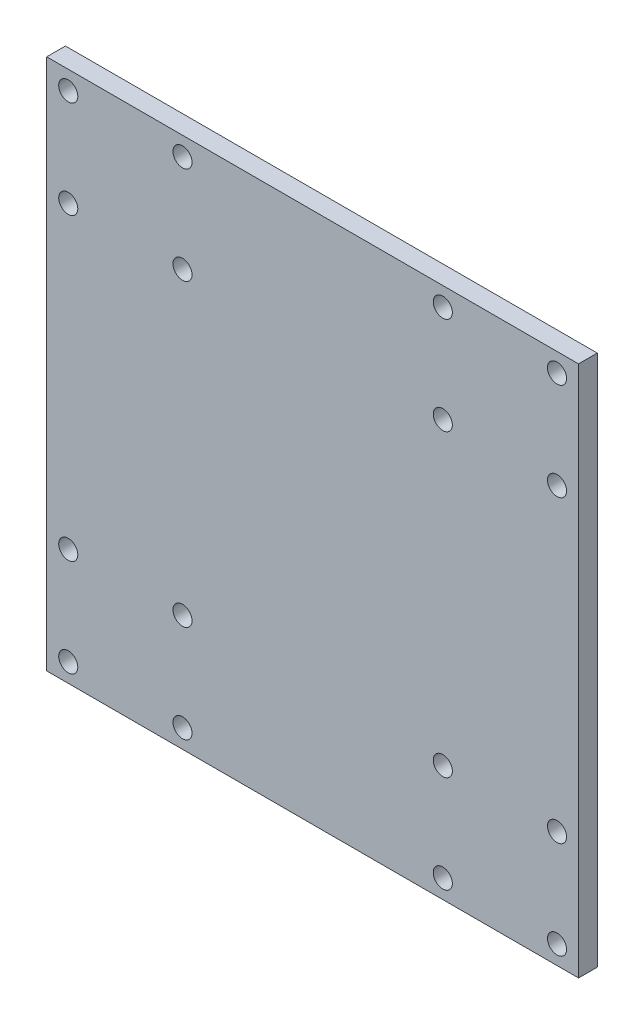
ISO-10303-21;
HEADER;
FILE_DESCRIPTION(('STEP AP214'),'2;1');
FILE_NAME('part.step','',(''),(''),'','','');
FILE_SCHEMA(('AUTOMOTIVE_DESIGN { 1 0 10303 214 1 1 1 1 }'));
ENDSEC;
DATA;
#1=APPLICATION_CONTEXT('core data for automotive mechanical design processes');
#2=APPLICATION_PROTOCOL_DEFINITION('international standard','automotive_design',2000,#1);
#3=PRODUCT_CONTEXT('',#1,'mechanical');
#4=PRODUCT('Part','Part','',(#3));
#5=PRODUCT_RELATED_PRODUCT_CATEGORY('part','',(#4));
#6=PRODUCT_DEFINITION_FORMATION('','',#4);
#7=PRODUCT_DEFINITION_CONTEXT('part definition',#1,'design');
#8=PRODUCT_DEFINITION('design','',#6,#7);
#9=PRODUCT_DEFINITION_SHAPE('','',#8);
#10=(LENGTH_UNIT() NAMED_UNIT(*) SI_UNIT(.MILLI.,.METRE.));
#11=(NAMED_UNIT(*) PLANE_ANGLE_UNIT() SI_UNIT($,.RADIAN.));
#12=(NAMED_UNIT(*) SI_UNIT($,.STERADIAN.) SOLID_ANGLE_UNIT());
#13=UNCERTAINTY_MEASURE_WITH_UNIT(LENGTH_MEASURE(1.E-05),#10,'distance_accuracy_value','');
#14=(GEOMETRIC_REPRESENTATION_CONTEXT(3) GLOBAL_UNCERTAINTY_ASSIGNED_CONTEXT((#13)) GLOBAL_UNIT_ASSIGNED_CONTEXT((#10,
#11,#12)) REPRESENTATION_CONTEXT('',''));
#15=CARTESIAN_POINT('',(0.,0.,0.));
#16=DIRECTION('',(0.,0.,1.));
#17=DIRECTION('',(1.,0.,0.));
#18=AXIS2_PLACEMENT_3D('',#15,#16,#17);
#19=CARTESIAN_POINT('',(71.,-71.,2.5));
#20=DIRECTION('',(-1.,0.,0.));
#21=DIRECTION('',(0.,0.,1.));
#22=AXIS2_PLACEMENT_3D('',#19,#20,#21);
#23=PLANE('',#22);
#24=DIRECTION('',(0.,1.,0.));
#25=VECTOR('',#24,1.);
#26=CARTESIAN_POINT('',(71.,-71.,-2.5));
#27=LINE('',#26,#25);
#28=CARTESIAN_POINT('',(71.,-71.,-2.5));
#29=VERTEX_POINT('',#28);
#30=CARTESIAN_POINT('',(71.,71.,-2.5));
#31=VERTEX_POINT('',#30);
#32=EDGE_CURVE('E95',#29,#31,#27,.T.);
#33=ORIENTED_EDGE('',*,*,#32,.T.);
#34=DIRECTION('',(0.,0.,-1.));
#35=VECTOR('',#34,1.);
#36=CARTESIAN_POINT('',(71.,71.,2.5));
#37=LINE('',#36,#35);
#38=CARTESIAN_POINT('',(71.,71.,2.5));
#39=VERTEX_POINT('',#38);
#40=EDGE_CURVE('E11',#39,#31,#37,.T.);
#41=ORIENTED_EDGE('',*,*,#40,.F.);
#42=DIRECTION('',(0.,1.,0.));
#43=VECTOR('',#42,1.);
#44=CARTESIAN_POINT('',(71.,-71.,2.5));
#45=LINE('',#44,#43);
#46=CARTESIAN_POINT('',(71.,-71.,2.5));
#47=VERTEX_POINT('',#46);
#48=EDGE_CURVE('E83',#47,#39,#45,.T.);
#49=ORIENTED_EDGE('',*,*,#48,.F.);
#50=DIRECTION('',(0.,0.,-1.));
#51=VECTOR('',#50,1.);
#52=CARTESIAN_POINT('',(71.,-71.,2.5));
#53=LINE('',#52,#51);
#54=EDGE_CURVE('E91',#47,#29,#53,.T.);
#55=ORIENTED_EDGE('',*,*,#54,.T.);
#56=EDGE_LOOP('',(#33,#41,#49,#55));
#57=FACE_BOUND('',#56,.T.);
#58=ADVANCED_FACE('F32',(#57),#23,.F.);
#59=CARTESIAN_POINT('',(-71.,71.,2.5));
#60=DIRECTION('',(0.,-1.,0.));
#61=DIRECTION('',(0.,0.,-1.));
#62=AXIS2_PLACEMENT_3D('',#59,#60,#61);
#63=PLANE('',#62);
#64=DIRECTION('',(-1.,0.,0.));
#65=VECTOR('',#64,1.);
#66=CARTESIAN_POINT('',(-71.,71.,-2.5));
#67=LINE('',#66,#65);
#68=CARTESIAN_POINT('',(-71.,71.,-2.5));
#69=VERTEX_POINT('',#68);
#70=EDGE_CURVE('E87',#31,#69,#67,.T.);
#71=ORIENTED_EDGE('',*,*,#70,.T.);
#72=DIRECTION('',(0.,0.,-1.));
#73=VECTOR('',#72,1.);
#74=CARTESIAN_POINT('',(-71.,71.,2.5));
#75=LINE('',#74,#73);
#76=CARTESIAN_POINT('',(-71.,71.,2.5));
#77=VERTEX_POINT('',#76);
#78=EDGE_CURVE('E40',#77,#69,#75,.T.);
#79=ORIENTED_EDGE('',*,*,#78,.F.);
#80=DIRECTION('',(-1.,0.,0.));
#81=VECTOR('',#80,1.);
#82=CARTESIAN_POINT('',(-71.,71.,2.5));
#83=LINE('',#82,#81);
#84=EDGE_CURVE('E78',#39,#77,#83,.T.);
#85=ORIENTED_EDGE('',*,*,#84,.F.);
#86=ORIENTED_EDGE('',*,*,#40,.T.);
#87=EDGE_LOOP('',(#71,#79,#85,#86));
#88=FACE_BOUND('',#87,.T.);
#89=ADVANCED_FACE('F86',(#88),#63,.F.);
#90=CARTESIAN_POINT('',(-71.,-71.,2.5));
#91=DIRECTION('',(1.,0.,0.));
#92=DIRECTION('',(0.,0.,-1.));
#93=AXIS2_PLACEMENT_3D('',#90,#91,#92);
#94=PLANE('',#93);
#95=DIRECTION('',(0.,-1.,0.));
#96=VECTOR('',#95,1.);
#97=CARTESIAN_POINT('',(-71.,-71.,-2.5));
#98=LINE('',#97,#96);
#99=CARTESIAN_POINT('',(-71.,-71.,-2.5));
#100=VERTEX_POINT('',#99);
#101=EDGE_CURVE('E65',#69,#100,#98,.T.);
#102=ORIENTED_EDGE('',*,*,#101,.T.);
#103=DIRECTION('',(0.,0.,-1.));
#104=VECTOR('',#103,1.);
#105=CARTESIAN_POINT('',(-71.,-71.,2.5));
#106=LINE('',#105,#104);
#107=CARTESIAN_POINT('',(-71.,-71.,2.5));
#108=VERTEX_POINT('',#107);
#109=EDGE_CURVE('E88',#108,#100,#106,.T.);
#110=ORIENTED_EDGE('',*,*,#109,.F.);
#111=DIRECTION('',(0.,-1.,0.));
#112=VECTOR('',#111,1.);
#113=CARTESIAN_POINT('',(-71.,-71.,2.5));
#114=LINE('',#113,#112);
#115=EDGE_CURVE('E81',#77,#108,#114,.T.);
#116=ORIENTED_EDGE('',*,*,#115,.F.);
#117=ORIENTED_EDGE('',*,*,#78,.T.);
#118=EDGE_LOOP('',(#102,#110,#116,#117));
#119=FACE_BOUND('',#118,.T.);
#120=ADVANCED_FACE('F89',(#119),#94,.F.);
#121=CARTESIAN_POINT('',(-71.,-71.,2.5));
#122=DIRECTION('',(0.,1.,0.));
#123=DIRECTION('',(0.,0.,1.));
#124=AXIS2_PLACEMENT_3D('',#121,#122,#123);
#125=PLANE('',#124);
#126=DIRECTION('',(1.,0.,0.));
#127=VECTOR('',#126,1.);
#128=CARTESIAN_POINT('',(-71.,-71.,-2.5));
#129=LINE('',#128,#127);
#130=EDGE_CURVE('E71',#100,#29,#129,.T.);
#131=ORIENTED_EDGE('',*,*,#130,.T.);
#132=ORIENTED_EDGE('',*,*,#54,.F.);
#133=DIRECTION('',(1.,0.,0.));
#134=VECTOR('',#133,1.);
#135=CARTESIAN_POINT('',(-71.,-71.,2.5));
#136=LINE('',#135,#134);
#137=EDGE_CURVE('E48',#108,#47,#136,.T.);
#138=ORIENTED_EDGE('',*,*,#137,.F.);
#139=ORIENTED_EDGE('',*,*,#109,.T.);
#140=EDGE_LOOP('',(#131,#132,#138,#139));
#141=FACE_BOUND('',#140,.T.);
#142=ADVANCED_FACE('F103',(#141),#125,.F.);
#143=CARTESIAN_POINT('',(0.,0.,2.5));
#144=DIRECTION('',(0.,0.,-1.));
#145=DIRECTION('',(-1.,0.,0.));
#146=AXIS2_PLACEMENT_3D('',#143,#144,#145);
#147=PLANE('',#146);
#148=CARTESIAN_POINT('',(34.75,-66.,2.5));
#149=DIRECTION('',(0.,0.,1.));
#150=DIRECTION('',(1.,0.,0.));
#151=AXIS2_PLACEMENT_3D('',#148,#149,#150);
#152=CIRCLE('',#151,2.55);
#153=CARTESIAN_POINT('',(37.3,-66.,2.5));
#154=VERTEX_POINT('',#153);
#155=EDGE_CURVE('E199',#154,#154,#152,.T.);
#156=ORIENTED_EDGE('',*,*,#155,.F.);
#157=EDGE_LOOP('',(#156));
#158=FACE_BOUND('',#157,.T.);
#159=CARTESIAN_POINT('',(65.25,-66.,2.5));
#160=DIRECTION('',(0.,0.,1.));
#161=DIRECTION('',(1.,0.,0.));
#162=AXIS2_PLACEMENT_3D('',#159,#160,#161);
#163=CIRCLE('',#162,2.54999999999999);
#164=CARTESIAN_POINT('',(67.8,-66.,2.5));
#165=VERTEX_POINT('',#164);
#166=EDGE_CURVE('E193',#165,#165,#163,.T.);
#167=ORIENTED_EDGE('',*,*,#166,.F.);
#168=EDGE_LOOP('',(#167));
#169=FACE_BOUND('',#168,.T.);
#170=CARTESIAN_POINT('',(65.25,-40.,2.5));
#171=DIRECTION('',(0.,0.,1.));
#172=DIRECTION('',(1.,0.,0.));
#173=AXIS2_PLACEMENT_3D('',#170,#171,#172);
#174=CIRCLE('',#173,2.54999999999999);
#175=CARTESIAN_POINT('',(67.8,-40.,2.5));
#176=VERTEX_POINT('',#175);
#177=EDGE_CURVE('E187',#176,#176,#174,.T.);
#178=ORIENTED_EDGE('',*,*,#177,.F.);
#179=EDGE_LOOP('',(#178));
#180=FACE_BOUND('',#179,.T.);
#181=CARTESIAN_POINT('',(34.75,-40.,2.5));
#182=DIRECTION('',(0.,0.,1.));
#183=DIRECTION('',(1.,0.,0.));
#184=AXIS2_PLACEMENT_3D('',#181,#182,#183);
#185=CIRCLE('',#184,2.55000000000001);
#186=CARTESIAN_POINT('',(37.3,-40.,2.5));
#187=VERTEX_POINT('',#186);
#188=EDGE_CURVE('E181',#187,#187,#185,.T.);
#189=ORIENTED_EDGE('',*,*,#188,.F.);
#190=EDGE_LOOP('',(#189));
#191=FACE_BOUND('',#190,.T.);
#192=CARTESIAN_POINT('',(-65.25,-66.,2.5));
#193=DIRECTION('',(0.,0.,1.));
#194=DIRECTION('',(1.,0.,0.));
#195=AXIS2_PLACEMENT_3D('',#192,#193,#194);
#196=CIRCLE('',#195,2.54999999999999);
#197=CARTESIAN_POINT('',(-62.7,-66.,2.5));
#198=VERTEX_POINT('',#197);
#199=EDGE_CURVE('E175',#198,#198,#196,.T.);
#200=ORIENTED_EDGE('',*,*,#199,.F.);
#201=EDGE_LOOP('',(#200));
#202=FACE_BOUND('',#201,.T.);
#203=CARTESIAN_POINT('',(-34.75,-66.,2.5));
#204=DIRECTION('',(0.,0.,1.));
#205=DIRECTION('',(1.,0.,0.));
#206=AXIS2_PLACEMENT_3D('',#203,#204,#205);
#207=CIRCLE('',#206,2.55);
#208=CARTESIAN_POINT('',(-32.2,-66.,2.5));
#209=VERTEX_POINT('',#208);
#210=EDGE_CURVE('E169',#209,#209,#207,.T.);
#211=ORIENTED_EDGE('',*,*,#210,.F.);
#212=EDGE_LOOP('',(#211));
#213=FACE_BOUND('',#212,.T.);
#214=CARTESIAN_POINT('',(-34.75,-40.,2.5));
#215=DIRECTION('',(0.,0.,1.));
#216=DIRECTION('',(1.,0.,0.));
#217=AXIS2_PLACEMENT_3D('',#214,#215,#216);
#218=CIRCLE('',#217,2.55000000000001);
#219=CARTESIAN_POINT('',(-32.2,-40.,2.5));
#220=VERTEX_POINT('',#219);
#221=EDGE_CURVE('E163',#220,#220,#218,.T.);
#222=ORIENTED_EDGE('',*,*,#221,.F.);
#223=EDGE_LOOP('',(#222));
#224=FACE_BOUND('',#223,.T.);
#225=CARTESIAN_POINT('',(-65.25,-40.,2.5));
#226=DIRECTION('',(0.,0.,1.));
#227=DIRECTION('',(1.,0.,0.));
#228=AXIS2_PLACEMENT_3D('',#225,#226,#227);
#229=CIRCLE('',#228,2.54999999999999);
#230=CARTESIAN_POINT('',(-62.7,-40.,2.5));
#231=VERTEX_POINT('',#230);
#232=EDGE_CURVE('E157',#231,#231,#229,.T.);
#233=ORIENTED_EDGE('',*,*,#232,.F.);
#234=EDGE_LOOP('',(#233));
#235=FACE_BOUND('',#234,.T.);
#236=CARTESIAN_POINT('',(34.75,66.,2.5));
#237=DIRECTION('',(0.,0.,1.));
#238=DIRECTION('',(1.,0.,0.));
#239=AXIS2_PLACEMENT_3D('',#236,#237,#238);
#240=CIRCLE('',#239,2.55);
#241=CARTESIAN_POINT('',(37.3,66.,2.5));
#242=VERTEX_POINT('',#241);
#243=EDGE_CURVE('E151',#242,#242,#240,.T.);
#244=ORIENTED_EDGE('',*,*,#243,.F.);
#245=EDGE_LOOP('',(#244));
#246=FACE_BOUND('',#245,.T.);
#247=CARTESIAN_POINT('',(34.75,40.,2.5));
#248=DIRECTION('',(0.,0.,1.));
#249=DIRECTION('',(1.,0.,0.));
#250=AXIS2_PLACEMENT_3D('',#247,#248,#249);
#251=CIRCLE('',#250,2.55000000000001);
#252=CARTESIAN_POINT('',(37.3,40.,2.5));
#253=VERTEX_POINT('',#252);
#254=EDGE_CURVE('E145',#253,#253,#251,.T.);
#255=ORIENTED_EDGE('',*,*,#254,.F.);
#256=EDGE_LOOP('',(#255));
#257=FACE_BOUND('',#256,.T.);
#258=CARTESIAN_POINT('',(65.25,40.,2.5));
#259=DIRECTION('',(0.,0.,1.));
#260=DIRECTION('',(1.,0.,0.));
#261=AXIS2_PLACEMENT_3D('',#258,#259,#260);
#262=CIRCLE('',#261,2.54999999999999);
#263=CARTESIAN_POINT('',(67.8,40.,2.5));
#264=VERTEX_POINT('',#263);
#265=EDGE_CURVE('E139',#264,#264,#262,.T.);
#266=ORIENTED_EDGE('',*,*,#265,.F.);
#267=EDGE_LOOP('',(#266));
#268=FACE_BOUND('',#267,.T.);
#269=CARTESIAN_POINT('',(65.25,66.,2.5));
#270=DIRECTION('',(0.,0.,1.));
#271=DIRECTION('',(1.,0.,0.));
#272=AXIS2_PLACEMENT_3D('',#269,#270,#271);
#273=CIRCLE('',#272,2.54999999999999);
#274=CARTESIAN_POINT('',(67.8,66.,2.5));
#275=VERTEX_POINT('',#274);
#276=EDGE_CURVE('E133',#275,#275,#273,.T.);
#277=ORIENTED_EDGE('',*,*,#276,.F.);
#278=EDGE_LOOP('',(#277));
#279=FACE_BOUND('',#278,.T.);
#280=CARTESIAN_POINT('',(-65.25,40.,2.5));
#281=DIRECTION('',(0.,0.,1.));
#282=DIRECTION('',(1.,0.,0.));
#283=AXIS2_PLACEMENT_3D('',#280,#281,#282);
#284=CIRCLE('',#283,2.54999999999999);
#285=CARTESIAN_POINT('',(-62.7,40.,2.5));
#286=VERTEX_POINT('',#285);
#287=EDGE_CURVE('E127',#286,#286,#284,.T.);
#288=ORIENTED_EDGE('',*,*,#287,.F.);
#289=EDGE_LOOP('',(#288));
#290=FACE_BOUND('',#289,.T.);
#291=CARTESIAN_POINT('',(-34.75,40.,2.5));
#292=DIRECTION('',(0.,0.,1.));
#293=DIRECTION('',(1.,0.,0.));
#294=AXIS2_PLACEMENT_3D('',#291,#292,#293);
#295=CIRCLE('',#294,2.55);
#296=CARTESIAN_POINT('',(-32.2,40.,2.5));
#297=VERTEX_POINT('',#296);
#298=EDGE_CURVE('E121',#297,#297,#295,.T.);
#299=ORIENTED_EDGE('',*,*,#298,.F.);
#300=EDGE_LOOP('',(#299));
#301=FACE_BOUND('',#300,.T.);
#302=CARTESIAN_POINT('',(-34.75,66.,2.5));
#303=DIRECTION('',(0.,0.,1.));
#304=DIRECTION('',(1.,0.,0.));
#305=AXIS2_PLACEMENT_3D('',#302,#303,#304);
#306=CIRCLE('',#305,2.55);
#307=CARTESIAN_POINT('',(-32.2,66.,2.5));
#308=VERTEX_POINT('',#307);
#309=EDGE_CURVE('E115',#308,#308,#306,.T.);
#310=ORIENTED_EDGE('',*,*,#309,.F.);
#311=EDGE_LOOP('',(#310));
#312=FACE_BOUND('',#311,.T.);
#313=CARTESIAN_POINT('',(-65.25,66.,2.5));
#314=DIRECTION('',(0.,0.,1.));
#315=DIRECTION('',(1.,0.,0.));
#316=AXIS2_PLACEMENT_3D('',#313,#314,#315);
#317=CIRCLE('',#316,2.54999999999999);
#318=CARTESIAN_POINT('',(-62.7,66.,2.5));
#319=VERTEX_POINT('',#318);
#320=EDGE_CURVE('E109',#319,#319,#317,.T.);
#321=ORIENTED_EDGE('',*,*,#320,.F.);
#322=EDGE_LOOP('',(#321));
#323=FACE_BOUND('',#322,.T.);
#324=ORIENTED_EDGE('',*,*,#48,.T.);
#325=ORIENTED_EDGE('',*,*,#84,.T.);
#326=ORIENTED_EDGE('',*,*,#115,.T.);
#327=ORIENTED_EDGE('',*,*,#137,.T.);
#328=EDGE_LOOP('',(#324,#325,#326,#327));
#329=FACE_BOUND('',#328,.T.);
#330=ADVANCED_FACE('F79',(#158,#169,#180,#191,#202,#213,#224,#235,#246,#257,#268,#279,#290,#301,
#312,#323,#329),#147,.F.);
#331=CARTESIAN_POINT('',(0.,0.,-2.5));
#332=DIRECTION('',(0.,0.,-1.));
#333=DIRECTION('',(-1.,0.,0.));
#334=AXIS2_PLACEMENT_3D('',#331,#332,#333);
#335=PLANE('',#334);
#336=CARTESIAN_POINT('',(34.75,-66.,-2.5));
#337=DIRECTION('',(0.,0.,1.));
#338=DIRECTION('',(1.,0.,0.));
#339=AXIS2_PLACEMENT_3D('',#336,#337,#338);
#340=CIRCLE('',#339,2.55);
#341=CARTESIAN_POINT('',(37.3,-66.,-2.5));
#342=VERTEX_POINT('',#341);
#343=EDGE_CURVE('E196',#342,#342,#340,.T.);
#344=ORIENTED_EDGE('',*,*,#343,.T.);
#345=EDGE_LOOP('',(#344));
#346=FACE_BOUND('',#345,.T.);
#347=CARTESIAN_POINT('',(65.25,-66.,-2.5));
#348=DIRECTION('',(0.,0.,1.));
#349=DIRECTION('',(1.,0.,0.));
#350=AXIS2_PLACEMENT_3D('',#347,#348,#349);
#351=CIRCLE('',#350,2.54999999999999);
#352=CARTESIAN_POINT('',(67.8,-66.,-2.5));
#353=VERTEX_POINT('',#352);
#354=EDGE_CURVE('E190',#353,#353,#351,.T.);
#355=ORIENTED_EDGE('',*,*,#354,.T.);
#356=EDGE_LOOP('',(#355));
#357=FACE_BOUND('',#356,.T.);
#358=CARTESIAN_POINT('',(65.25,-40.,-2.5));
#359=DIRECTION('',(0.,0.,1.));
#360=DIRECTION('',(1.,0.,0.));
#361=AXIS2_PLACEMENT_3D('',#358,#359,#360);
#362=CIRCLE('',#361,2.54999999999999);
#363=CARTESIAN_POINT('',(67.8,-40.,-2.5));
#364=VERTEX_POINT('',#363);
#365=EDGE_CURVE('E184',#364,#364,#362,.T.);
#366=ORIENTED_EDGE('',*,*,#365,.T.);
#367=EDGE_LOOP('',(#366));
#368=FACE_BOUND('',#367,.T.);
#369=CARTESIAN_POINT('',(34.75,-40.,-2.5));
#370=DIRECTION('',(0.,0.,1.));
#371=DIRECTION('',(1.,0.,0.));
#372=AXIS2_PLACEMENT_3D('',#369,#370,#371);
#373=CIRCLE('',#372,2.55000000000001);
#374=CARTESIAN_POINT('',(37.3,-40.,-2.5));
#375=VERTEX_POINT('',#374);
#376=EDGE_CURVE('E178',#375,#375,#373,.T.);
#377=ORIENTED_EDGE('',*,*,#376,.T.);
#378=EDGE_LOOP('',(#377));
#379=FACE_BOUND('',#378,.T.);
#380=CARTESIAN_POINT('',(-65.25,-66.,-2.5));
#381=DIRECTION('',(0.,0.,1.));
#382=DIRECTION('',(1.,0.,0.));
#383=AXIS2_PLACEMENT_3D('',#380,#381,#382);
#384=CIRCLE('',#383,2.54999999999999);
#385=CARTESIAN_POINT('',(-62.7,-66.,-2.5));
#386=VERTEX_POINT('',#385);
#387=EDGE_CURVE('E172',#386,#386,#384,.T.);
#388=ORIENTED_EDGE('',*,*,#387,.T.);
#389=EDGE_LOOP('',(#388));
#390=FACE_BOUND('',#389,.T.);
#391=CARTESIAN_POINT('',(-34.75,-66.,-2.5));
#392=DIRECTION('',(0.,0.,1.));
#393=DIRECTION('',(1.,0.,0.));
#394=AXIS2_PLACEMENT_3D('',#391,#392,#393);
#395=CIRCLE('',#394,2.55);
#396=CARTESIAN_POINT('',(-32.2,-66.,-2.5));
#397=VERTEX_POINT('',#396);
#398=EDGE_CURVE('E166',#397,#397,#395,.T.);
#399=ORIENTED_EDGE('',*,*,#398,.T.);
#400=EDGE_LOOP('',(#399));
#401=FACE_BOUND('',#400,.T.);
#402=CARTESIAN_POINT('',(-34.75,-40.,-2.5));
#403=DIRECTION('',(0.,0.,1.));
#404=DIRECTION('',(1.,0.,0.));
#405=AXIS2_PLACEMENT_3D('',#402,#403,#404);
#406=CIRCLE('',#405,2.55000000000001);
#407=CARTESIAN_POINT('',(-32.2,-40.,-2.5));
#408=VERTEX_POINT('',#407);
#409=EDGE_CURVE('E160',#408,#408,#406,.T.);
#410=ORIENTED_EDGE('',*,*,#409,.T.);
#411=EDGE_LOOP('',(#410));
#412=FACE_BOUND('',#411,.T.);
#413=CARTESIAN_POINT('',(-65.25,-40.,-2.5));
#414=DIRECTION('',(0.,0.,1.));
#415=DIRECTION('',(1.,0.,0.));
#416=AXIS2_PLACEMENT_3D('',#413,#414,#415);
#417=CIRCLE('',#416,2.54999999999999);
#418=CARTESIAN_POINT('',(-62.7,-40.,-2.5));
#419=VERTEX_POINT('',#418);
#420=EDGE_CURVE('E154',#419,#419,#417,.T.);
#421=ORIENTED_EDGE('',*,*,#420,.T.);
#422=EDGE_LOOP('',(#421));
#423=FACE_BOUND('',#422,.T.);
#424=CARTESIAN_POINT('',(34.75,66.,-2.5));
#425=DIRECTION('',(0.,0.,1.));
#426=DIRECTION('',(1.,0.,0.));
#427=AXIS2_PLACEMENT_3D('',#424,#425,#426);
#428=CIRCLE('',#427,2.55);
#429=CARTESIAN_POINT('',(37.3,66.,-2.5));
#430=VERTEX_POINT('',#429);
#431=EDGE_CURVE('E148',#430,#430,#428,.T.);
#432=ORIENTED_EDGE('',*,*,#431,.T.);
#433=EDGE_LOOP('',(#432));
#434=FACE_BOUND('',#433,.T.);
#435=CARTESIAN_POINT('',(34.75,40.,-2.5));
#436=DIRECTION('',(0.,0.,1.));
#437=DIRECTION('',(1.,0.,0.));
#438=AXIS2_PLACEMENT_3D('',#435,#436,#437);
#439=CIRCLE('',#438,2.55000000000001);
#440=CARTESIAN_POINT('',(37.3,40.,-2.5));
#441=VERTEX_POINT('',#440);
#442=EDGE_CURVE('E142',#441,#441,#439,.T.);
#443=ORIENTED_EDGE('',*,*,#442,.T.);
#444=EDGE_LOOP('',(#443));
#445=FACE_BOUND('',#444,.T.);
#446=CARTESIAN_POINT('',(65.25,40.,-2.5));
#447=DIRECTION('',(0.,0.,1.));
#448=DIRECTION('',(1.,0.,0.));
#449=AXIS2_PLACEMENT_3D('',#446,#447,#448);
#450=CIRCLE('',#449,2.54999999999999);
#451=CARTESIAN_POINT('',(67.8,40.,-2.5));
#452=VERTEX_POINT('',#451);
#453=EDGE_CURVE('E136',#452,#452,#450,.T.);
#454=ORIENTED_EDGE('',*,*,#453,.T.);
#455=EDGE_LOOP('',(#454));
#456=FACE_BOUND('',#455,.T.);
#457=CARTESIAN_POINT('',(65.25,66.,-2.5));
#458=DIRECTION('',(0.,0.,1.));
#459=DIRECTION('',(1.,0.,0.));
#460=AXIS2_PLACEMENT_3D('',#457,#458,#459);
#461=CIRCLE('',#460,2.54999999999999);
#462=CARTESIAN_POINT('',(67.8,66.,-2.5));
#463=VERTEX_POINT('',#462);
#464=EDGE_CURVE('E130',#463,#463,#461,.T.);
#465=ORIENTED_EDGE('',*,*,#464,.T.);
#466=EDGE_LOOP('',(#465));
#467=FACE_BOUND('',#466,.T.);
#468=CARTESIAN_POINT('',(-65.25,40.,-2.5));
#469=DIRECTION('',(0.,0.,1.));
#470=DIRECTION('',(1.,0.,0.));
#471=AXIS2_PLACEMENT_3D('',#468,#469,#470);
#472=CIRCLE('',#471,2.54999999999999);
#473=CARTESIAN_POINT('',(-62.7,40.,-2.5));
#474=VERTEX_POINT('',#473);
#475=EDGE_CURVE('E124',#474,#474,#472,.T.);
#476=ORIENTED_EDGE('',*,*,#475,.T.);
#477=EDGE_LOOP('',(#476));
#478=FACE_BOUND('',#477,.T.);
#479=CARTESIAN_POINT('',(-34.75,40.,-2.5));
#480=DIRECTION('',(0.,0.,1.));
#481=DIRECTION('',(1.,0.,0.));
#482=AXIS2_PLACEMENT_3D('',#479,#480,#481);
#483=CIRCLE('',#482,2.55);
#484=CARTESIAN_POINT('',(-32.2,40.,-2.5));
#485=VERTEX_POINT('',#484);
#486=EDGE_CURVE('E118',#485,#485,#483,.T.);
#487=ORIENTED_EDGE('',*,*,#486,.T.);
#488=EDGE_LOOP('',(#487));
#489=FACE_BOUND('',#488,.T.);
#490=CARTESIAN_POINT('',(-34.75,66.,-2.5));
#491=DIRECTION('',(0.,0.,1.));
#492=DIRECTION('',(1.,0.,0.));
#493=AXIS2_PLACEMENT_3D('',#490,#491,#492);
#494=CIRCLE('',#493,2.55);
#495=CARTESIAN_POINT('',(-32.2,66.,-2.5));
#496=VERTEX_POINT('',#495);
#497=EDGE_CURVE('E112',#496,#496,#494,.T.);
#498=ORIENTED_EDGE('',*,*,#497,.T.);
#499=EDGE_LOOP('',(#498));
#500=FACE_BOUND('',#499,.T.);
#501=CARTESIAN_POINT('',(-65.25,66.,-2.5));
#502=DIRECTION('',(0.,0.,1.));
#503=DIRECTION('',(1.,0.,0.));
#504=AXIS2_PLACEMENT_3D('',#501,#502,#503);
#505=CIRCLE('',#504,2.54999999999999);
#506=CARTESIAN_POINT('',(-62.7,66.,-2.5));
#507=VERTEX_POINT('',#506);
#508=EDGE_CURVE('E98',#507,#507,#505,.T.);
#509=ORIENTED_EDGE('',*,*,#508,.T.);
#510=EDGE_LOOP('',(#509));
#511=FACE_BOUND('',#510,.T.);
#512=ORIENTED_EDGE('',*,*,#32,.F.);
#513=ORIENTED_EDGE('',*,*,#130,.F.);
#514=ORIENTED_EDGE('',*,*,#101,.F.);
#515=ORIENTED_EDGE('',*,*,#70,.F.);
#516=EDGE_LOOP('',(#512,#513,#514,#515));
#517=FACE_BOUND('',#516,.T.);
#518=ADVANCED_FACE('F106',(#346,#357,#368,#379,#390,#401,#412,#423,#434,#445,#456,#467,#478,
#489,#500,#511,#517),#335,.T.);
#519=CARTESIAN_POINT('',(-65.25,66.,-2.5));
#520=DIRECTION('',(0.,0.,1.));
#521=DIRECTION('',(1.,0.,0.));
#522=AXIS2_PLACEMENT_3D('',#519,#520,#521);
#523=CYLINDRICAL_SURFACE('',#522,2.54999999999999);
#524=ORIENTED_EDGE('',*,*,#508,.F.);
#525=EDGE_LOOP('',(#524));
#526=FACE_BOUND('',#525,.T.);
#527=ORIENTED_EDGE('',*,*,#320,.T.);
#528=EDGE_LOOP('',(#527));
#529=FACE_BOUND('',#528,.T.);
#530=ADVANCED_FACE('F247',(#526,#529),#523,.F.);
#531=CARTESIAN_POINT('',(-34.75,66.,-2.5));
#532=DIRECTION('',(0.,0.,1.));
#533=DIRECTION('',(1.,0.,0.));
#534=AXIS2_PLACEMENT_3D('',#531,#532,#533);
#535=CYLINDRICAL_SURFACE('',#534,2.55);
#536=ORIENTED_EDGE('',*,*,#497,.F.);
#537=EDGE_LOOP('',(#536));
#538=FACE_BOUND('',#537,.T.);
#539=ORIENTED_EDGE('',*,*,#309,.T.);
#540=EDGE_LOOP('',(#539));
#541=FACE_BOUND('',#540,.T.);
#542=ADVANCED_FACE('F249',(#538,#541),#535,.F.);
#543=CARTESIAN_POINT('',(-34.75,40.,-2.5));
#544=DIRECTION('',(0.,0.,1.));
#545=DIRECTION('',(1.,0.,0.));
#546=AXIS2_PLACEMENT_3D('',#543,#544,#545);
#547=CYLINDRICAL_SURFACE('',#546,2.55);
#548=ORIENTED_EDGE('',*,*,#486,.F.);
#549=EDGE_LOOP('',(#548));
#550=FACE_BOUND('',#549,.T.);
#551=ORIENTED_EDGE('',*,*,#298,.T.);
#552=EDGE_LOOP('',(#551));
#553=FACE_BOUND('',#552,.T.);
#554=ADVANCED_FACE('F256',(#550,#553),#547,.F.);
#555=CARTESIAN_POINT('',(-65.25,40.,-2.5));
#556=DIRECTION('',(0.,0.,1.));
#557=DIRECTION('',(1.,0.,0.));
#558=AXIS2_PLACEMENT_3D('',#555,#556,#557);
#559=CYLINDRICAL_SURFACE('',#558,2.54999999999999);
#560=ORIENTED_EDGE('',*,*,#475,.F.);
#561=EDGE_LOOP('',(#560));
#562=FACE_BOUND('',#561,.T.);
#563=ORIENTED_EDGE('',*,*,#287,.T.);
#564=EDGE_LOOP('',(#563));
#565=FACE_BOUND('',#564,.T.);
#566=ADVANCED_FACE('F302',(#562,#565),#559,.F.);
#567=CARTESIAN_POINT('',(65.25,66.,-2.5));
#568=DIRECTION('',(0.,0.,1.));
#569=DIRECTION('',(1.,0.,0.));
#570=AXIS2_PLACEMENT_3D('',#567,#568,#569);
#571=CYLINDRICAL_SURFACE('',#570,2.54999999999999);
#572=ORIENTED_EDGE('',*,*,#464,.F.);
#573=EDGE_LOOP('',(#572));
#574=FACE_BOUND('',#573,.T.);
#575=ORIENTED_EDGE('',*,*,#276,.T.);
#576=EDGE_LOOP('',(#575));
#577=FACE_BOUND('',#576,.T.);
#578=ADVANCED_FACE('F312',(#574,#577),#571,.F.);
#579=CARTESIAN_POINT('',(65.25,40.,-2.5));
#580=DIRECTION('',(0.,0.,1.));
#581=DIRECTION('',(1.,0.,0.));
#582=AXIS2_PLACEMENT_3D('',#579,#580,#581);
#583=CYLINDRICAL_SURFACE('',#582,2.54999999999999);
#584=ORIENTED_EDGE('',*,*,#453,.F.);
#585=EDGE_LOOP('',(#584));
#586=FACE_BOUND('',#585,.T.);
#587=ORIENTED_EDGE('',*,*,#265,.T.);
#588=EDGE_LOOP('',(#587));
#589=FACE_BOUND('',#588,.T.);
#590=ADVANCED_FACE('F322',(#586,#589),#583,.F.);
#591=CARTESIAN_POINT('',(34.75,40.,-2.5));
#592=DIRECTION('',(0.,0.,1.));
#593=DIRECTION('',(1.,0.,0.));
#594=AXIS2_PLACEMENT_3D('',#591,#592,#593);
#595=CYLINDRICAL_SURFACE('',#594,2.55000000000001);
#596=ORIENTED_EDGE('',*,*,#442,.F.);
#597=EDGE_LOOP('',(#596));
#598=FACE_BOUND('',#597,.T.);
#599=ORIENTED_EDGE('',*,*,#254,.T.);
#600=EDGE_LOOP('',(#599));
#601=FACE_BOUND('',#600,.T.);
#602=ADVANCED_FACE('F332',(#598,#601),#595,.F.);
#603=CARTESIAN_POINT('',(34.75,66.,-2.5));
#604=DIRECTION('',(0.,0.,1.));
#605=DIRECTION('',(1.,0.,0.));
#606=AXIS2_PLACEMENT_3D('',#603,#604,#605);
#607=CYLINDRICAL_SURFACE('',#606,2.55);
#608=ORIENTED_EDGE('',*,*,#431,.F.);
#609=EDGE_LOOP('',(#608));
#610=FACE_BOUND('',#609,.T.);
#611=ORIENTED_EDGE('',*,*,#243,.T.);
#612=EDGE_LOOP('',(#611));
#613=FACE_BOUND('',#612,.T.);
#614=ADVANCED_FACE('F342',(#610,#613),#607,.F.);
#615=CARTESIAN_POINT('',(-65.25,-40.,-2.5));
#616=DIRECTION('',(0.,0.,1.));
#617=DIRECTION('',(1.,0.,0.));
#618=AXIS2_PLACEMENT_3D('',#615,#616,#617);
#619=CYLINDRICAL_SURFACE('',#618,2.54999999999999);
#620=ORIENTED_EDGE('',*,*,#420,.F.);
#621=EDGE_LOOP('',(#620));
#622=FACE_BOUND('',#621,.T.);
#623=ORIENTED_EDGE('',*,*,#232,.T.);
#624=EDGE_LOOP('',(#623));
#625=FACE_BOUND('',#624,.T.);
#626=ADVANCED_FACE('F352',(#622,#625),#619,.F.);
#627=CARTESIAN_POINT('',(-34.75,-40.,-2.5));
#628=DIRECTION('',(0.,0.,1.));
#629=DIRECTION('',(1.,0.,0.));
#630=AXIS2_PLACEMENT_3D('',#627,#628,#629);
#631=CYLINDRICAL_SURFACE('',#630,2.55000000000001);
#632=ORIENTED_EDGE('',*,*,#409,.F.);
#633=EDGE_LOOP('',(#632));
#634=FACE_BOUND('',#633,.T.);
#635=ORIENTED_EDGE('',*,*,#221,.T.);
#636=EDGE_LOOP('',(#635));
#637=FACE_BOUND('',#636,.T.);
#638=ADVANCED_FACE('F362',(#634,#637),#631,.F.);
#639=CARTESIAN_POINT('',(-34.75,-66.,-2.5));
#640=DIRECTION('',(0.,0.,1.));
#641=DIRECTION('',(1.,0.,0.));
#642=AXIS2_PLACEMENT_3D('',#639,#640,#641);
#643=CYLINDRICAL_SURFACE('',#642,2.55);
#644=ORIENTED_EDGE('',*,*,#398,.F.);
#645=EDGE_LOOP('',(#644));
#646=FACE_BOUND('',#645,.T.);
#647=ORIENTED_EDGE('',*,*,#210,.T.);
#648=EDGE_LOOP('',(#647));
#649=FACE_BOUND('',#648,.T.);
#650=ADVANCED_FACE('F372',(#646,#649),#643,.F.);
#651=CARTESIAN_POINT('',(-65.25,-66.,-2.5));
#652=DIRECTION('',(0.,0.,1.));
#653=DIRECTION('',(1.,0.,0.));
#654=AXIS2_PLACEMENT_3D('',#651,#652,#653);
#655=CYLINDRICAL_SURFACE('',#654,2.54999999999999);
#656=ORIENTED_EDGE('',*,*,#387,.F.);
#657=EDGE_LOOP('',(#656));
#658=FACE_BOUND('',#657,.T.);
#659=ORIENTED_EDGE('',*,*,#199,.T.);
#660=EDGE_LOOP('',(#659));
#661=FACE_BOUND('',#660,.T.);
#662=ADVANCED_FACE('F382',(#658,#661),#655,.F.);
#663=CARTESIAN_POINT('',(34.75,-40.,-2.5));
#664=DIRECTION('',(0.,0.,1.));
#665=DIRECTION('',(1.,0.,0.));
#666=AXIS2_PLACEMENT_3D('',#663,#664,#665);
#667=CYLINDRICAL_SURFACE('',#666,2.55000000000001);
#668=ORIENTED_EDGE('',*,*,#376,.F.);
#669=EDGE_LOOP('',(#668));
#670=FACE_BOUND('',#669,.T.);
#671=ORIENTED_EDGE('',*,*,#188,.T.);
#672=EDGE_LOOP('',(#671));
#673=FACE_BOUND('',#672,.T.);
#674=ADVANCED_FACE('F392',(#670,#673),#667,.F.);
#675=CARTESIAN_POINT('',(65.25,-40.,-2.5));
#676=DIRECTION('',(0.,0.,1.));
#677=DIRECTION('',(1.,0.,0.));
#678=AXIS2_PLACEMENT_3D('',#675,#676,#677);
#679=CYLINDRICAL_SURFACE('',#678,2.54999999999999);
#680=ORIENTED_EDGE('',*,*,#365,.F.);
#681=EDGE_LOOP('',(#680));
#682=FACE_BOUND('',#681,.T.);
#683=ORIENTED_EDGE('',*,*,#177,.T.);
#684=EDGE_LOOP('',(#683));
#685=FACE_BOUND('',#684,.T.);
#686=ADVANCED_FACE('F402',(#682,#685),#679,.F.);
#687=CARTESIAN_POINT('',(65.25,-66.,-2.5));
#688=DIRECTION('',(0.,0.,1.));
#689=DIRECTION('',(1.,0.,0.));
#690=AXIS2_PLACEMENT_3D('',#687,#688,#689);
#691=CYLINDRICAL_SURFACE('',#690,2.54999999999999);
#692=ORIENTED_EDGE('',*,*,#354,.F.);
#693=EDGE_LOOP('',(#692));
#694=FACE_BOUND('',#693,.T.);
#695=ORIENTED_EDGE('',*,*,#166,.T.);
#696=EDGE_LOOP('',(#695));
#697=FACE_BOUND('',#696,.T.);
#698=ADVANCED_FACE('F210',(#694,#697),#691,.F.);
#699=CARTESIAN_POINT('',(34.75,-66.,-2.5));
#700=DIRECTION('',(0.,0.,1.));
#701=DIRECTION('',(1.,0.,0.));
#702=AXIS2_PLACEMENT_3D('',#699,#700,#701);
#703=CYLINDRICAL_SURFACE('',#702,2.55);
#704=ORIENTED_EDGE('',*,*,#343,.F.);
#705=EDGE_LOOP('',(#704));
#706=FACE_BOUND('',#705,.T.);
#707=ORIENTED_EDGE('',*,*,#155,.T.);
#708=EDGE_LOOP('',(#707));
#709=FACE_BOUND('',#708,.T.);
#710=ADVANCED_FACE('F207',(#706,#709),#703,.F.);
#711=CLOSED_SHELL('',(#58,#89,#120,#142,#330,#518,#530,#542,#554,#566,#578,#590,#602,#614,#626,
#638,#650,#662,#674,#686,#698,#710));
#712=MANIFOLD_SOLID_BREP('B2',#711);
#713=ADVANCED_BREP_SHAPE_REPRESENTATION('',(#18,#712),#14);
#714=SHAPE_DEFINITION_REPRESENTATION(#9,#713);
ENDSEC;
END-ISO-10303-21;
